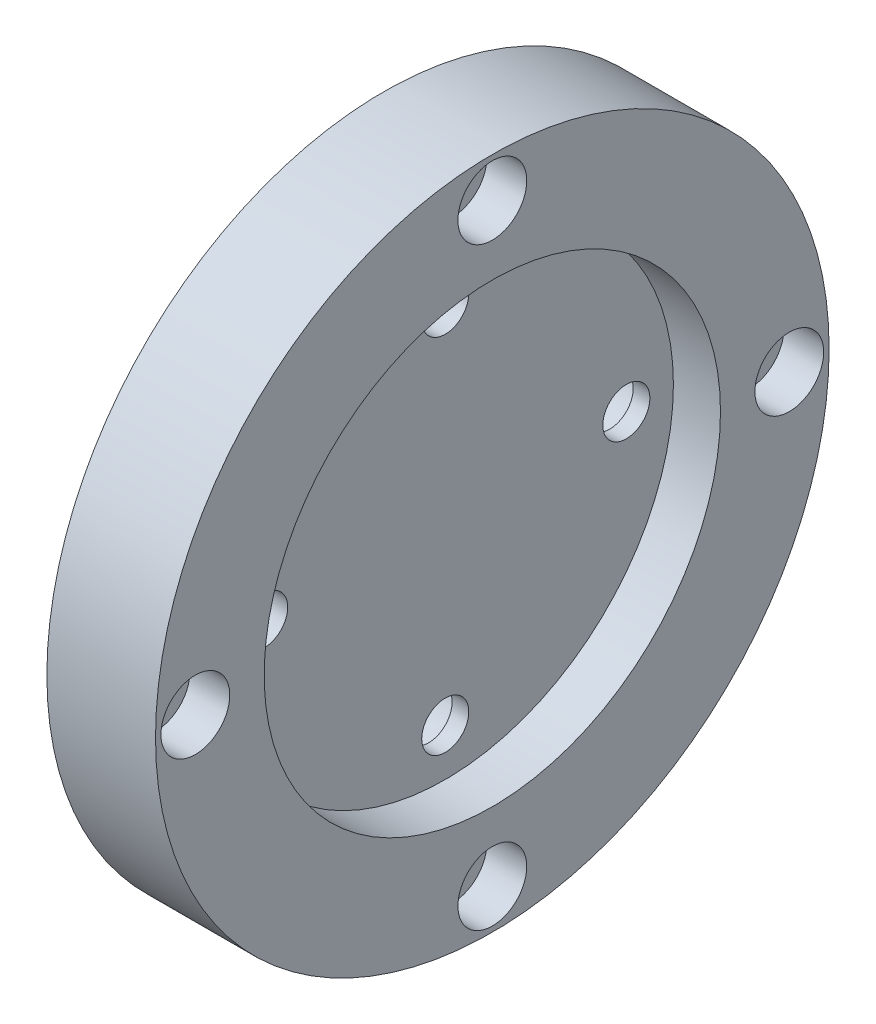
ISO-10303-21;
HEADER;
FILE_DESCRIPTION(('STEP AP214'),'2;1');
FILE_NAME('part.step','',(''),(''),'','','');
FILE_SCHEMA(('AUTOMOTIVE_DESIGN { 1 0 10303 214 1 1 1 1 }'));
ENDSEC;
DATA;
#1=APPLICATION_CONTEXT('core data for automotive mechanical design processes');
#2=APPLICATION_PROTOCOL_DEFINITION('international standard','automotive_design',2000,#1);
#3=PRODUCT_CONTEXT('',#1,'mechanical');
#4=PRODUCT('Part','Part','',(#3));
#5=PRODUCT_RELATED_PRODUCT_CATEGORY('part','',(#4));
#6=PRODUCT_DEFINITION_FORMATION('','',#4);
#7=PRODUCT_DEFINITION_CONTEXT('part definition',#1,'design');
#8=PRODUCT_DEFINITION('design','',#6,#7);
#9=PRODUCT_DEFINITION_SHAPE('','',#8);
#10=(LENGTH_UNIT() NAMED_UNIT(*) SI_UNIT(.MILLI.,.METRE.));
#11=(NAMED_UNIT(*) PLANE_ANGLE_UNIT() SI_UNIT($,.RADIAN.));
#12=(NAMED_UNIT(*) SI_UNIT($,.STERADIAN.) SOLID_ANGLE_UNIT());
#13=UNCERTAINTY_MEASURE_WITH_UNIT(LENGTH_MEASURE(1.E-05),#10,'distance_accuracy_value','');
#14=(GEOMETRIC_REPRESENTATION_CONTEXT(3) GLOBAL_UNCERTAINTY_ASSIGNED_CONTEXT((#13)) GLOBAL_UNIT_ASSIGNED_CONTEXT((#10,
#11,#12)) REPRESENTATION_CONTEXT('',''));
#15=CARTESIAN_POINT('',(0.,0.,0.));
#16=DIRECTION('',(0.,0.,1.));
#17=DIRECTION('',(1.,0.,0.));
#18=AXIS2_PLACEMENT_3D('',#15,#16,#17);
#19=CARTESIAN_POINT('',(0.,0.,-41.));
#20=DIRECTION('',(1.,0.,0.));
#21=DIRECTION('',(0.,0.,-1.));
#22=AXIS2_PLACEMENT_3D('',#19,#20,#21);
#23=CYLINDRICAL_SURFACE('',#22,2.75);
#24=CARTESIAN_POINT('',(0.,0.,-41.));
#25=DIRECTION('',(1.,0.,0.));
#26=DIRECTION('',(0.,0.,-1.));
#27=AXIS2_PLACEMENT_3D('',#24,#25,#26);
#28=CIRCLE('',#27,2.75);
#29=CARTESIAN_POINT('',(0.,0.,-43.75));
#30=VERTEX_POINT('',#29);
#31=EDGE_CURVE('E99',#30,#30,#28,.T.);
#32=ORIENTED_EDGE('',*,*,#31,.F.);
#33=EDGE_LOOP('',(#32));
#34=FACE_BOUND('',#33,.T.);
#35=CARTESIAN_POINT('',(9.5,0.,-41.));
#36=DIRECTION('',(1.,0.,0.));
#37=DIRECTION('',(0.,0.,-1.));
#38=AXIS2_PLACEMENT_3D('',#35,#36,#37);
#39=CIRCLE('',#38,2.75);
#40=CARTESIAN_POINT('',(9.5,0.,-43.75));
#41=VERTEX_POINT('',#40);
#42=EDGE_CURVE('E43',#41,#41,#39,.F.);
#43=ORIENTED_EDGE('',*,*,#42,.F.);
#44=EDGE_LOOP('',(#43));
#45=FACE_BOUND('',#44,.T.);
#46=ADVANCED_FACE('F39',(#34,#45),#23,.F.);
#47=CARTESIAN_POINT('',(0.,0.,41.));
#48=DIRECTION('',(1.,0.,0.));
#49=DIRECTION('',(0.,0.,-1.));
#50=AXIS2_PLACEMENT_3D('',#47,#48,#49);
#51=CYLINDRICAL_SURFACE('',#50,2.75);
#52=CARTESIAN_POINT('',(0.,0.,41.));
#53=DIRECTION('',(1.,0.,0.));
#54=DIRECTION('',(0.,0.,1.));
#55=AXIS2_PLACEMENT_3D('',#52,#53,#54);
#56=CIRCLE('',#55,2.75);
#57=CARTESIAN_POINT('',(0.,0.,43.75));
#58=VERTEX_POINT('',#57);
#59=EDGE_CURVE('E100',#58,#58,#56,.T.);
#60=ORIENTED_EDGE('',*,*,#59,.F.);
#61=EDGE_LOOP('',(#60));
#62=FACE_BOUND('',#61,.T.);
#63=CARTESIAN_POINT('',(9.5,0.,41.));
#64=DIRECTION('',(1.,0.,0.));
#65=DIRECTION('',(0.,0.,-1.));
#66=AXIS2_PLACEMENT_3D('',#63,#64,#65);
#67=CIRCLE('',#66,2.75);
#68=CARTESIAN_POINT('',(9.5,0.,38.25));
#69=VERTEX_POINT('',#68);
#70=EDGE_CURVE('E79',#69,#69,#67,.F.);
#71=ORIENTED_EDGE('',*,*,#70,.F.);
#72=EDGE_LOOP('',(#71));
#73=FACE_BOUND('',#72,.T.);
#74=ADVANCED_FACE('F164',(#62,#73),#51,.F.);
#75=CARTESIAN_POINT('',(0.,41.,1.43150734892568E-13));
#76=DIRECTION('',(1.,0.,0.));
#77=DIRECTION('',(0.,0.,-1.));
#78=AXIS2_PLACEMENT_3D('',#75,#76,#77);
#79=CYLINDRICAL_SURFACE('',#78,2.75);
#80=CARTESIAN_POINT('',(0.,41.,1.43150734892568E-13));
#81=DIRECTION('',(1.,0.,0.));
#82=DIRECTION('',(0.,1.,0.));
#83=AXIS2_PLACEMENT_3D('',#80,#81,#82);
#84=CIRCLE('',#83,2.75);
#85=CARTESIAN_POINT('',(0.,43.75,1.52752308574387E-13));
#86=VERTEX_POINT('',#85);
#87=EDGE_CURVE('E96',#86,#86,#84,.T.);
#88=ORIENTED_EDGE('',*,*,#87,.F.);
#89=EDGE_LOOP('',(#88));
#90=FACE_BOUND('',#89,.T.);
#91=CARTESIAN_POINT('',(9.5,41.,1.43150734892568E-13));
#92=DIRECTION('',(1.,0.,0.));
#93=DIRECTION('',(0.,0.,-1.));
#94=AXIS2_PLACEMENT_3D('',#91,#92,#93);
#95=CIRCLE('',#94,2.75);
#96=CARTESIAN_POINT('',(9.5,41.,-2.74999999999986));
#97=VERTEX_POINT('',#96);
#98=EDGE_CURVE('E77',#97,#97,#95,.F.);
#99=ORIENTED_EDGE('',*,*,#98,.F.);
#100=EDGE_LOOP('',(#99));
#101=FACE_BOUND('',#100,.T.);
#102=ADVANCED_FACE('F170',(#90,#101),#79,.F.);
#103=CARTESIAN_POINT('',(0.,-41.,-4.29452204677705E-13));
#104=DIRECTION('',(1.,0.,0.));
#105=DIRECTION('',(0.,0.,-1.));
#106=AXIS2_PLACEMENT_3D('',#103,#104,#105);
#107=CYLINDRICAL_SURFACE('',#106,2.75);
#108=CARTESIAN_POINT('',(0.,-41.,-4.29452204677705E-13));
#109=DIRECTION('',(1.,0.,0.));
#110=DIRECTION('',(0.,-1.,0.));
#111=AXIS2_PLACEMENT_3D('',#108,#109,#110);
#112=CIRCLE('',#111,2.75);
#113=CARTESIAN_POINT('',(0.,-43.75,-4.58256925723161E-13));
#114=VERTEX_POINT('',#113);
#115=EDGE_CURVE('E75',#114,#114,#112,.T.);
#116=ORIENTED_EDGE('',*,*,#115,.F.);
#117=EDGE_LOOP('',(#116));
#118=FACE_BOUND('',#117,.T.);
#119=CARTESIAN_POINT('',(9.5,-41.,-4.29452204677705E-13));
#120=DIRECTION('',(1.,0.,0.));
#121=DIRECTION('',(0.,0.,-1.));
#122=AXIS2_PLACEMENT_3D('',#119,#120,#121);
#123=CIRCLE('',#122,2.75);
#124=CARTESIAN_POINT('',(9.5,-41.,-2.75000000000043));
#125=VERTEX_POINT('',#124);
#126=EDGE_CURVE('E72',#125,#125,#123,.F.);
#127=ORIENTED_EDGE('',*,*,#126,.F.);
#128=EDGE_LOOP('',(#127));
#129=FACE_BOUND('',#128,.T.);
#130=ADVANCED_FACE('F177',(#118,#129),#107,.F.);
#131=CARTESIAN_POINT('',(0.,25.,0.));
#132=DIRECTION('',(1.,0.,0.));
#133=DIRECTION('',(0.,0.,-1.));
#134=AXIS2_PLACEMENT_3D('',#131,#132,#133);
#135=CYLINDRICAL_SURFACE('',#134,3.25);
#136=CARTESIAN_POINT('',(8.5,25.,0.));
#137=DIRECTION('',(1.,0.,0.));
#138=DIRECTION('',(0.,0.,-1.));
#139=AXIS2_PLACEMENT_3D('',#136,#137,#138);
#140=CIRCLE('',#139,3.25);
#141=CARTESIAN_POINT('',(8.5,25.,-3.25));
#142=VERTEX_POINT('',#141);
#143=EDGE_CURVE('E133',#142,#142,#140,.T.);
#144=ORIENTED_EDGE('',*,*,#143,.T.);
#145=EDGE_LOOP('',(#144));
#146=FACE_BOUND('',#145,.T.);
#147=CARTESIAN_POINT('',(6.2,25.,0.));
#148=DIRECTION('',(-1.,0.,0.));
#149=DIRECTION('',(0.,0.,1.));
#150=AXIS2_PLACEMENT_3D('',#147,#148,#149);
#151=CIRCLE('',#150,3.25);
#152=CARTESIAN_POINT('',(6.2,25.,3.25));
#153=VERTEX_POINT('',#152);
#154=EDGE_CURVE('E68',#153,#153,#151,.F.);
#155=ORIENTED_EDGE('',*,*,#154,.F.);
#156=EDGE_LOOP('',(#155));
#157=FACE_BOUND('',#156,.T.);
#158=ADVANCED_FACE('F222',(#146,#157),#135,.F.);
#159=CARTESIAN_POINT('',(0.,2.61861100413235E-13,25.));
#160=DIRECTION('',(1.,0.,0.));
#161=DIRECTION('',(0.,0.,-1.));
#162=AXIS2_PLACEMENT_3D('',#159,#160,#161);
#163=CYLINDRICAL_SURFACE('',#162,3.25);
#164=CARTESIAN_POINT('',(8.5,2.61861100413235E-13,25.));
#165=DIRECTION('',(1.,0.,0.));
#166=DIRECTION('',(0.,1.,0.));
#167=AXIS2_PLACEMENT_3D('',#164,#165,#166);
#168=CIRCLE('',#167,3.25);
#169=CARTESIAN_POINT('',(8.5,3.25000000000026,25.));
#170=VERTEX_POINT('',#169);
#171=EDGE_CURVE('E71',#170,#170,#168,.T.);
#172=ORIENTED_EDGE('',*,*,#171,.T.);
#173=EDGE_LOOP('',(#172));
#174=FACE_BOUND('',#173,.T.);
#175=CARTESIAN_POINT('',(6.2,2.61861100413235E-13,25.));
#176=DIRECTION('',(-1.,0.,0.));
#177=DIRECTION('',(0.,0.,1.));
#178=AXIS2_PLACEMENT_3D('',#175,#176,#177);
#179=CIRCLE('',#178,3.25);
#180=CARTESIAN_POINT('',(6.2,2.61861100413235E-13,28.25));
#181=VERTEX_POINT('',#180);
#182=EDGE_CURVE('E65',#181,#181,#179,.F.);
#183=ORIENTED_EDGE('',*,*,#182,.F.);
#184=EDGE_LOOP('',(#183));
#185=FACE_BOUND('',#184,.T.);
#186=ADVANCED_FACE('F218',(#174,#185),#163,.F.);
#187=CARTESIAN_POINT('',(0.,-25.,0.));
#188=DIRECTION('',(1.,0.,0.));
#189=DIRECTION('',(0.,0.,-1.));
#190=AXIS2_PLACEMENT_3D('',#187,#188,#189);
#191=CYLINDRICAL_SURFACE('',#190,3.25);
#192=CARTESIAN_POINT('',(8.5,-25.,0.));
#193=DIRECTION('',(1.,0.,0.));
#194=DIRECTION('',(0.,0.,1.));
#195=AXIS2_PLACEMENT_3D('',#192,#193,#194);
#196=CIRCLE('',#195,3.25);
#197=CARTESIAN_POINT('',(8.5,-25.,3.25));
#198=VERTEX_POINT('',#197);
#199=EDGE_CURVE('E134',#198,#198,#196,.T.);
#200=ORIENTED_EDGE('',*,*,#199,.T.);
#201=EDGE_LOOP('',(#200));
#202=FACE_BOUND('',#201,.T.);
#203=CARTESIAN_POINT('',(6.2,-25.,0.));
#204=DIRECTION('',(-1.,0.,0.));
#205=DIRECTION('',(0.,0.,1.));
#206=AXIS2_PLACEMENT_3D('',#203,#204,#205);
#207=CIRCLE('',#206,3.25);
#208=CARTESIAN_POINT('',(6.2,-25.,3.25));
#209=VERTEX_POINT('',#208);
#210=EDGE_CURVE('E61',#209,#209,#207,.F.);
#211=ORIENTED_EDGE('',*,*,#210,.F.);
#212=EDGE_LOOP('',(#211));
#213=FACE_BOUND('',#212,.T.);
#214=ADVANCED_FACE('F214',(#202,#213),#191,.F.);
#215=CARTESIAN_POINT('',(0.,0.,-25.));
#216=DIRECTION('',(1.,0.,0.));
#217=DIRECTION('',(0.,0.,-1.));
#218=AXIS2_PLACEMENT_3D('',#215,#216,#217);
#219=CYLINDRICAL_SURFACE('',#218,3.25);
#220=CARTESIAN_POINT('',(8.5,0.,-25.));
#221=DIRECTION('',(1.,0.,0.));
#222=DIRECTION('',(0.,-1.,0.));
#223=AXIS2_PLACEMENT_3D('',#220,#221,#222);
#224=CIRCLE('',#223,3.25);
#225=CARTESIAN_POINT('',(8.5,-3.25000000000009,-25.));
#226=VERTEX_POINT('',#225);
#227=EDGE_CURVE('E130',#226,#226,#224,.T.);
#228=ORIENTED_EDGE('',*,*,#227,.T.);
#229=EDGE_LOOP('',(#228));
#230=FACE_BOUND('',#229,.T.);
#231=CARTESIAN_POINT('',(6.2,0.,-25.));
#232=DIRECTION('',(-1.,0.,0.));
#233=DIRECTION('',(0.,0.,1.));
#234=AXIS2_PLACEMENT_3D('',#231,#232,#233);
#235=CIRCLE('',#234,3.25);
#236=CARTESIAN_POINT('',(6.2,0.,-21.75));
#237=VERTEX_POINT('',#236);
#238=EDGE_CURVE('E58',#237,#237,#235,.F.);
#239=ORIENTED_EDGE('',*,*,#238,.F.);
#240=EDGE_LOOP('',(#239));
#241=FACE_BOUND('',#240,.T.);
#242=ADVANCED_FACE('F158',(#230,#241),#219,.F.);
#243=CARTESIAN_POINT('',(15.,0.,0.));
#244=DIRECTION('',(-1.,0.,0.));
#245=DIRECTION('',(0.,0.,1.));
#246=AXIS2_PLACEMENT_3D('',#243,#244,#245);
#247=CYLINDRICAL_SURFACE('',#246,46.5);
#248=CARTESIAN_POINT('',(15.,0.,0.));
#249=DIRECTION('',(1.,0.,0.));
#250=DIRECTION('',(0.,0.,-1.));
#251=AXIS2_PLACEMENT_3D('',#248,#249,#250);
#252=CIRCLE('',#251,46.5);
#253=CARTESIAN_POINT('',(15.,0.,-46.5));
#254=VERTEX_POINT('',#253);
#255=EDGE_CURVE('E10',#254,#254,#252,.T.);
#256=ORIENTED_EDGE('',*,*,#255,.F.);
#257=EDGE_LOOP('',(#256));
#258=FACE_BOUND('',#257,.T.);
#259=CARTESIAN_POINT('',(0.,0.,0.));
#260=DIRECTION('',(1.,0.,0.));
#261=DIRECTION('',(0.,0.,-1.));
#262=AXIS2_PLACEMENT_3D('',#259,#260,#261);
#263=CIRCLE('',#262,46.5);
#264=CARTESIAN_POINT('',(0.,0.,-46.5));
#265=VERTEX_POINT('',#264);
#266=EDGE_CURVE('E47',#265,#265,#263,.T.);
#267=ORIENTED_EDGE('',*,*,#266,.T.);
#268=EDGE_LOOP('',(#267));
#269=FACE_BOUND('',#268,.T.);
#270=ADVANCED_FACE('F41',(#258,#269),#247,.T.);
#271=CARTESIAN_POINT('',(15.,0.,0.));
#272=DIRECTION('',(1.,0.,0.));
#273=DIRECTION('',(0.,0.,-1.));
#274=AXIS2_PLACEMENT_3D('',#271,#272,#273);
#275=PLANE('',#274);
#276=CARTESIAN_POINT('',(15.,5.73362156934817E-13,-41.));
#277=DIRECTION('',(1.,0.,0.));
#278=DIRECTION('',(0.,1.,0.));
#279=AXIS2_PLACEMENT_3D('',#276,#277,#278);
#280=CIRCLE('',#279,4.75);
#281=CARTESIAN_POINT('',(15.,4.75000000000057,-41.));
#282=VERTEX_POINT('',#281);
#283=EDGE_CURVE('E527',#282,#282,#280,.T.);
#284=ORIENTED_EDGE('',*,*,#283,.F.);
#285=EDGE_LOOP('',(#284));
#286=FACE_BOUND('',#285,.T.);
#287=CARTESIAN_POINT('',(15.,41.,4.30211422042248E-13));
#288=DIRECTION('',(1.,0.,0.));
#289=DIRECTION('',(0.,0.,1.));
#290=AXIS2_PLACEMENT_3D('',#287,#288,#289);
#291=CIRCLE('',#290,4.75);
#292=CARTESIAN_POINT('',(15.,41.,4.75000000000043));
#293=VERTEX_POINT('',#292);
#294=EDGE_CURVE('E532',#293,#293,#291,.T.);
#295=ORIENTED_EDGE('',*,*,#294,.F.);
#296=EDGE_LOOP('',(#295));
#297=FACE_BOUND('',#296,.T.);
#298=CARTESIAN_POINT('',(15.,-8.59663626719954E-13,41.));
#299=DIRECTION('',(1.,0.,0.));
#300=DIRECTION('',(0.,-1.,0.));
#301=AXIS2_PLACEMENT_3D('',#298,#299,#300);
#302=CIRCLE('',#301,4.75);
#303=CARTESIAN_POINT('',(15.,-4.75000000000086,41.));
#304=VERTEX_POINT('',#303);
#305=EDGE_CURVE('E539',#304,#304,#302,.T.);
#306=ORIENTED_EDGE('',*,*,#305,.F.);
#307=EDGE_LOOP('',(#306));
#308=FACE_BOUND('',#307,.T.);
#309=CARTESIAN_POINT('',(15.,-41.,-4.30211422042248E-13));
#310=DIRECTION('',(1.,0.,0.));
#311=DIRECTION('',(0.,0.,-1.));
#312=AXIS2_PLACEMENT_3D('',#309,#310,#311);
#313=CIRCLE('',#312,4.75);
#314=CARTESIAN_POINT('',(15.,-41.,-4.75000000000043));
#315=VERTEX_POINT('',#314);
#316=EDGE_CURVE('E85',#315,#315,#313,.T.);
#317=ORIENTED_EDGE('',*,*,#316,.F.);
#318=EDGE_LOOP('',(#317));
#319=FACE_BOUND('',#318,.T.);
#320=CARTESIAN_POINT('',(15.,0.,0.));
#321=DIRECTION('',(1.,0.,0.));
#322=DIRECTION('',(0.,0.,-1.));
#323=AXIS2_PLACEMENT_3D('',#320,#321,#322);
#324=CIRCLE('',#323,31.5);
#325=CARTESIAN_POINT('',(15.,0.,-31.5));
#326=VERTEX_POINT('',#325);
#327=EDGE_CURVE('E55',#326,#326,#324,.T.);
#328=ORIENTED_EDGE('',*,*,#327,.F.);
#329=EDGE_LOOP('',(#328));
#330=FACE_BOUND('',#329,.T.);
#331=ORIENTED_EDGE('',*,*,#255,.T.);
#332=EDGE_LOOP('',(#331));
#333=FACE_BOUND('',#332,.T.);
#334=ADVANCED_FACE('F148',(#286,#297,#308,#319,#330,#333),#275,.T.);
#335=CARTESIAN_POINT('',(0.,0.,0.));
#336=DIRECTION('',(1.,0.,0.));
#337=DIRECTION('',(0.,0.,-1.));
#338=AXIS2_PLACEMENT_3D('',#335,#336,#337);
#339=PLANE('',#338);
#340=ORIENTED_EDGE('',*,*,#87,.T.);
#341=EDGE_LOOP('',(#340));
#342=FACE_BOUND('',#341,.T.);
#343=ORIENTED_EDGE('',*,*,#59,.T.);
#344=EDGE_LOOP('',(#343));
#345=FACE_BOUND('',#344,.T.);
#346=ORIENTED_EDGE('',*,*,#115,.T.);
#347=EDGE_LOOP('',(#346));
#348=FACE_BOUND('',#347,.T.);
#349=ORIENTED_EDGE('',*,*,#31,.T.);
#350=EDGE_LOOP('',(#349));
#351=FACE_BOUND('',#350,.T.);
#352=CARTESIAN_POINT('',(0.,25.,0.));
#353=DIRECTION('',(-1.,0.,0.));
#354=DIRECTION('',(0.,0.,1.));
#355=AXIS2_PLACEMENT_3D('',#352,#353,#354);
#356=CIRCLE('',#355,5.5);
#357=CARTESIAN_POINT('',(0.,25.,5.5));
#358=VERTEX_POINT('',#357);
#359=EDGE_CURVE('E110',#358,#358,#356,.T.);
#360=ORIENTED_EDGE('',*,*,#359,.F.);
#361=EDGE_LOOP('',(#360));
#362=FACE_BOUND('',#361,.T.);
#363=CARTESIAN_POINT('',(0.,0.,-25.));
#364=DIRECTION('',(-1.,0.,0.));
#365=DIRECTION('',(0.,0.,1.));
#366=AXIS2_PLACEMENT_3D('',#363,#364,#365);
#367=CIRCLE('',#366,5.5);
#368=CARTESIAN_POINT('',(0.,0.,-19.5));
#369=VERTEX_POINT('',#368);
#370=EDGE_CURVE('E113',#369,#369,#367,.T.);
#371=ORIENTED_EDGE('',*,*,#370,.F.);
#372=EDGE_LOOP('',(#371));
#373=FACE_BOUND('',#372,.T.);
#374=CARTESIAN_POINT('',(0.,-25.,0.));
#375=DIRECTION('',(-1.,0.,0.));
#376=DIRECTION('',(0.,0.,1.));
#377=AXIS2_PLACEMENT_3D('',#374,#375,#376);
#378=CIRCLE('',#377,5.5);
#379=CARTESIAN_POINT('',(0.,-25.,5.5));
#380=VERTEX_POINT('',#379);
#381=EDGE_CURVE('E119',#380,#380,#378,.T.);
#382=ORIENTED_EDGE('',*,*,#381,.F.);
#383=EDGE_LOOP('',(#382));
#384=FACE_BOUND('',#383,.T.);
#385=CARTESIAN_POINT('',(0.,2.61861100413235E-13,25.));
#386=DIRECTION('',(-1.,0.,0.));
#387=DIRECTION('',(0.,0.,1.));
#388=AXIS2_PLACEMENT_3D('',#385,#386,#387);
#389=CIRCLE('',#388,5.5);
#390=CARTESIAN_POINT('',(0.,2.61861100413235E-13,30.5));
#391=VERTEX_POINT('',#390);
#392=EDGE_CURVE('E125',#391,#391,#389,.T.);
#393=ORIENTED_EDGE('',*,*,#392,.F.);
#394=EDGE_LOOP('',(#393));
#395=FACE_BOUND('',#394,.T.);
#396=ORIENTED_EDGE('',*,*,#266,.F.);
#397=EDGE_LOOP('',(#396));
#398=FACE_BOUND('',#397,.T.);
#399=ADVANCED_FACE('F150',(#342,#345,#348,#351,#362,#373,#384,#395,#398),#339,.F.);
#400=CARTESIAN_POINT('',(8.5,0.,0.));
#401=DIRECTION('',(1.,0.,0.));
#402=DIRECTION('',(0.,0.,-1.));
#403=AXIS2_PLACEMENT_3D('',#400,#401,#402);
#404=CYLINDRICAL_SURFACE('',#403,31.5);
#405=CARTESIAN_POINT('',(8.5,0.,0.));
#406=DIRECTION('',(1.,0.,0.));
#407=DIRECTION('',(0.,0.,-1.));
#408=AXIS2_PLACEMENT_3D('',#405,#406,#407);
#409=CIRCLE('',#408,31.5);
#410=CARTESIAN_POINT('',(8.5,0.,-31.5));
#411=VERTEX_POINT('',#410);
#412=EDGE_CURVE('E52',#411,#411,#409,.T.);
#413=ORIENTED_EDGE('',*,*,#412,.F.);
#414=EDGE_LOOP('',(#413));
#415=FACE_BOUND('',#414,.T.);
#416=ORIENTED_EDGE('',*,*,#327,.T.);
#417=EDGE_LOOP('',(#416));
#418=FACE_BOUND('',#417,.T.);
#419=ADVANCED_FACE('F146',(#415,#418),#404,.F.);
#420=CARTESIAN_POINT('',(8.5,0.,0.));
#421=DIRECTION('',(1.,0.,0.));
#422=DIRECTION('',(0.,0.,-1.));
#423=AXIS2_PLACEMENT_3D('',#420,#421,#422);
#424=PLANE('',#423);
#425=ORIENTED_EDGE('',*,*,#227,.F.);
#426=EDGE_LOOP('',(#425));
#427=FACE_BOUND('',#426,.T.);
#428=ORIENTED_EDGE('',*,*,#199,.F.);
#429=EDGE_LOOP('',(#428));
#430=FACE_BOUND('',#429,.T.);
#431=ORIENTED_EDGE('',*,*,#171,.F.);
#432=EDGE_LOOP('',(#431));
#433=FACE_BOUND('',#432,.T.);
#434=ORIENTED_EDGE('',*,*,#143,.F.);
#435=EDGE_LOOP('',(#434));
#436=FACE_BOUND('',#435,.T.);
#437=ORIENTED_EDGE('',*,*,#412,.T.);
#438=EDGE_LOOP('',(#437));
#439=FACE_BOUND('',#438,.T.);
#440=ADVANCED_FACE('F196',(#427,#430,#433,#436,#439),#424,.T.);
#441=CARTESIAN_POINT('',(6.2,0.,-25.));
#442=DIRECTION('',(-1.,0.,0.));
#443=DIRECTION('',(0.,0.,1.));
#444=AXIS2_PLACEMENT_3D('',#441,#442,#443);
#445=PLANE('',#444);
#446=CARTESIAN_POINT('',(6.2,0.,-25.));
#447=DIRECTION('',(-1.,0.,0.));
#448=DIRECTION('',(0.,0.,1.));
#449=AXIS2_PLACEMENT_3D('',#446,#447,#448);
#450=CIRCLE('',#449,5.5);
#451=CARTESIAN_POINT('',(6.2,0.,-19.5));
#452=VERTEX_POINT('',#451);
#453=EDGE_CURVE('E116',#452,#452,#450,.T.);
#454=ORIENTED_EDGE('',*,*,#453,.T.);
#455=EDGE_LOOP('',(#454));
#456=FACE_BOUND('',#455,.T.);
#457=ORIENTED_EDGE('',*,*,#238,.T.);
#458=EDGE_LOOP('',(#457));
#459=FACE_BOUND('',#458,.T.);
#460=ADVANCED_FACE('F192',(#456,#459),#445,.T.);
#461=CARTESIAN_POINT('',(6.2,0.,-25.));
#462=DIRECTION('',(-1.,0.,0.));
#463=DIRECTION('',(0.,0.,1.));
#464=AXIS2_PLACEMENT_3D('',#461,#462,#463);
#465=CYLINDRICAL_SURFACE('',#464,5.5);
#466=ORIENTED_EDGE('',*,*,#453,.F.);
#467=EDGE_LOOP('',(#466));
#468=FACE_BOUND('',#467,.T.);
#469=ORIENTED_EDGE('',*,*,#370,.T.);
#470=EDGE_LOOP('',(#469));
#471=FACE_BOUND('',#470,.T.);
#472=ADVANCED_FACE('F188',(#468,#471),#465,.F.);
#473=CARTESIAN_POINT('',(6.2,-25.,0.));
#474=DIRECTION('',(-1.,0.,0.));
#475=DIRECTION('',(0.,0.,1.));
#476=AXIS2_PLACEMENT_3D('',#473,#474,#475);
#477=PLANE('',#476);
#478=CARTESIAN_POINT('',(6.2,-25.,0.));
#479=DIRECTION('',(-1.,0.,0.));
#480=DIRECTION('',(0.,0.,1.));
#481=AXIS2_PLACEMENT_3D('',#478,#479,#480);
#482=CIRCLE('',#481,5.5);
#483=CARTESIAN_POINT('',(6.2,-25.,5.5));
#484=VERTEX_POINT('',#483);
#485=EDGE_CURVE('E122',#484,#484,#482,.T.);
#486=ORIENTED_EDGE('',*,*,#485,.T.);
#487=EDGE_LOOP('',(#486));
#488=FACE_BOUND('',#487,.T.);
#489=ORIENTED_EDGE('',*,*,#210,.T.);
#490=EDGE_LOOP('',(#489));
#491=FACE_BOUND('',#490,.T.);
#492=ADVANCED_FACE('F191',(#488,#491),#477,.T.);
#493=CARTESIAN_POINT('',(6.2,-25.,0.));
#494=DIRECTION('',(-1.,0.,0.));
#495=DIRECTION('',(0.,0.,1.));
#496=AXIS2_PLACEMENT_3D('',#493,#494,#495);
#497=CYLINDRICAL_SURFACE('',#496,5.5);
#498=ORIENTED_EDGE('',*,*,#485,.F.);
#499=EDGE_LOOP('',(#498));
#500=FACE_BOUND('',#499,.T.);
#501=ORIENTED_EDGE('',*,*,#381,.T.);
#502=EDGE_LOOP('',(#501));
#503=FACE_BOUND('',#502,.T.);
#504=ADVANCED_FACE('F198',(#500,#503),#497,.F.);
#505=CARTESIAN_POINT('',(6.2,2.61861100413235E-13,25.));
#506=DIRECTION('',(-1.,0.,0.));
#507=DIRECTION('',(0.,0.,1.));
#508=AXIS2_PLACEMENT_3D('',#505,#506,#507);
#509=PLANE('',#508);
#510=CARTESIAN_POINT('',(6.2,2.61861100413235E-13,25.));
#511=DIRECTION('',(-1.,0.,0.));
#512=DIRECTION('',(0.,0.,1.));
#513=AXIS2_PLACEMENT_3D('',#510,#511,#512);
#514=CIRCLE('',#513,5.5);
#515=CARTESIAN_POINT('',(6.2,2.61861100413235E-13,30.5));
#516=VERTEX_POINT('',#515);
#517=EDGE_CURVE('E107',#516,#516,#514,.T.);
#518=ORIENTED_EDGE('',*,*,#517,.T.);
#519=EDGE_LOOP('',(#518));
#520=FACE_BOUND('',#519,.T.);
#521=ORIENTED_EDGE('',*,*,#182,.T.);
#522=EDGE_LOOP('',(#521));
#523=FACE_BOUND('',#522,.T.);
#524=ADVANCED_FACE('F201',(#520,#523),#509,.T.);
#525=CARTESIAN_POINT('',(6.2,2.61861100413235E-13,25.));
#526=DIRECTION('',(-1.,0.,0.));
#527=DIRECTION('',(0.,0.,1.));
#528=AXIS2_PLACEMENT_3D('',#525,#526,#527);
#529=CYLINDRICAL_SURFACE('',#528,5.5);
#530=ORIENTED_EDGE('',*,*,#517,.F.);
#531=EDGE_LOOP('',(#530));
#532=FACE_BOUND('',#531,.T.);
#533=ORIENTED_EDGE('',*,*,#392,.T.);
#534=EDGE_LOOP('',(#533));
#535=FACE_BOUND('',#534,.T.);
#536=ADVANCED_FACE('F182',(#532,#535),#529,.F.);
#537=CARTESIAN_POINT('',(6.2,25.,0.));
#538=DIRECTION('',(-1.,0.,0.));
#539=DIRECTION('',(0.,0.,1.));
#540=AXIS2_PLACEMENT_3D('',#537,#538,#539);
#541=PLANE('',#540);
#542=CARTESIAN_POINT('',(6.2,25.,0.));
#543=DIRECTION('',(-1.,0.,0.));
#544=DIRECTION('',(0.,0.,1.));
#545=AXIS2_PLACEMENT_3D('',#542,#543,#544);
#546=CIRCLE('',#545,5.5);
#547=CARTESIAN_POINT('',(6.2,25.,5.5));
#548=VERTEX_POINT('',#547);
#549=EDGE_CURVE('E62',#548,#548,#546,.T.);
#550=ORIENTED_EDGE('',*,*,#549,.T.);
#551=EDGE_LOOP('',(#550));
#552=FACE_BOUND('',#551,.T.);
#553=ORIENTED_EDGE('',*,*,#154,.T.);
#554=EDGE_LOOP('',(#553));
#555=FACE_BOUND('',#554,.T.);
#556=ADVANCED_FACE('F178',(#552,#555),#541,.T.);
#557=CARTESIAN_POINT('',(6.2,25.,0.));
#558=DIRECTION('',(-1.,0.,0.));
#559=DIRECTION('',(0.,0.,1.));
#560=AXIS2_PLACEMENT_3D('',#557,#558,#559);
#561=CYLINDRICAL_SURFACE('',#560,5.5);
#562=ORIENTED_EDGE('',*,*,#549,.F.);
#563=EDGE_LOOP('',(#562));
#564=FACE_BOUND('',#563,.T.);
#565=ORIENTED_EDGE('',*,*,#359,.T.);
#566=EDGE_LOOP('',(#565));
#567=FACE_BOUND('',#566,.T.);
#568=ADVANCED_FACE('F181',(#564,#567),#561,.F.);
#569=CARTESIAN_POINT('',(9.5,-41.,-4.30211422042248E-13));
#570=DIRECTION('',(1.,0.,0.));
#571=DIRECTION('',(0.,0.,-1.));
#572=AXIS2_PLACEMENT_3D('',#569,#570,#571);
#573=PLANE('',#572);
#574=CARTESIAN_POINT('',(9.5,-41.,-4.30211422042248E-13));
#575=DIRECTION('',(1.,0.,0.));
#576=DIRECTION('',(0.,0.,-1.));
#577=AXIS2_PLACEMENT_3D('',#574,#575,#576);
#578=CIRCLE('',#577,4.75);
#579=CARTESIAN_POINT('',(9.5,-41.,-4.75000000000043));
#580=VERTEX_POINT('',#579);
#581=EDGE_CURVE('E76',#580,#580,#578,.T.);
#582=ORIENTED_EDGE('',*,*,#581,.T.);
#583=EDGE_LOOP('',(#582));
#584=FACE_BOUND('',#583,.T.);
#585=ORIENTED_EDGE('',*,*,#126,.T.);
#586=EDGE_LOOP('',(#585));
#587=FACE_BOUND('',#586,.T.);
#588=ADVANCED_FACE('F186',(#584,#587),#573,.T.);
#589=CARTESIAN_POINT('',(9.5,-41.,-4.30211422042248E-13));
#590=DIRECTION('',(1.,0.,0.));
#591=DIRECTION('',(0.,0.,-1.));
#592=AXIS2_PLACEMENT_3D('',#589,#590,#591);
#593=CYLINDRICAL_SURFACE('',#592,4.75);
#594=ORIENTED_EDGE('',*,*,#581,.F.);
#595=EDGE_LOOP('',(#594));
#596=FACE_BOUND('',#595,.T.);
#597=ORIENTED_EDGE('',*,*,#316,.T.);
#598=EDGE_LOOP('',(#597));
#599=FACE_BOUND('',#598,.T.);
#600=ADVANCED_FACE('F280',(#596,#599),#593,.F.);
#601=CARTESIAN_POINT('',(9.5,41.,4.30211422042248E-13));
#602=DIRECTION('',(1.,0.,0.));
#603=DIRECTION('',(0.,0.,1.));
#604=AXIS2_PLACEMENT_3D('',#601,#602,#603);
#605=PLANE('',#604);
#606=CARTESIAN_POINT('',(9.5,41.,4.30211422042248E-13));
#607=DIRECTION('',(1.,0.,0.));
#608=DIRECTION('',(0.,0.,1.));
#609=AXIS2_PLACEMENT_3D('',#606,#607,#608);
#610=CIRCLE('',#609,4.75);
#611=CARTESIAN_POINT('',(9.5,41.,4.75000000000043));
#612=VERTEX_POINT('',#611);
#613=EDGE_CURVE('E528',#612,#612,#610,.T.);
#614=ORIENTED_EDGE('',*,*,#613,.T.);
#615=EDGE_LOOP('',(#614));
#616=FACE_BOUND('',#615,.T.);
#617=ORIENTED_EDGE('',*,*,#98,.T.);
#618=EDGE_LOOP('',(#617));
#619=FACE_BOUND('',#618,.T.);
#620=ADVANCED_FACE('F289',(#616,#619),#605,.T.);
#621=CARTESIAN_POINT('',(9.5,41.,4.30211422042248E-13));
#622=DIRECTION('',(1.,0.,0.));
#623=DIRECTION('',(0.,0.,-1.));
#624=AXIS2_PLACEMENT_3D('',#621,#622,#623);
#625=CYLINDRICAL_SURFACE('',#624,4.75);
#626=ORIENTED_EDGE('',*,*,#613,.F.);
#627=EDGE_LOOP('',(#626));
#628=FACE_BOUND('',#627,.T.);
#629=ORIENTED_EDGE('',*,*,#294,.T.);
#630=EDGE_LOOP('',(#629));
#631=FACE_BOUND('',#630,.T.);
#632=ADVANCED_FACE('F297',(#628,#631),#625,.F.);
#633=CARTESIAN_POINT('',(9.5,-8.59663626719954E-13,41.));
#634=DIRECTION('',(1.,0.,0.));
#635=DIRECTION('',(0.,-1.,0.));
#636=AXIS2_PLACEMENT_3D('',#633,#634,#635);
#637=PLANE('',#636);
#638=CARTESIAN_POINT('',(9.5,-8.59663626719954E-13,41.));
#639=DIRECTION('',(1.,0.,0.));
#640=DIRECTION('',(0.,-1.,0.));
#641=AXIS2_PLACEMENT_3D('',#638,#639,#640);
#642=CIRCLE('',#641,4.75);
#643=CARTESIAN_POINT('',(9.5,-4.75000000000086,41.));
#644=VERTEX_POINT('',#643);
#645=EDGE_CURVE('E537',#644,#644,#642,.T.);
#646=ORIENTED_EDGE('',*,*,#645,.T.);
#647=EDGE_LOOP('',(#646));
#648=FACE_BOUND('',#647,.T.);
#649=ORIENTED_EDGE('',*,*,#70,.T.);
#650=EDGE_LOOP('',(#649));
#651=FACE_BOUND('',#650,.T.);
#652=ADVANCED_FACE('F305',(#648,#651),#637,.T.);
#653=CARTESIAN_POINT('',(9.5,-8.59663626719954E-13,41.));
#654=DIRECTION('',(1.,0.,0.));
#655=DIRECTION('',(0.,0.,-1.));
#656=AXIS2_PLACEMENT_3D('',#653,#654,#655);
#657=CYLINDRICAL_SURFACE('',#656,4.75);
#658=ORIENTED_EDGE('',*,*,#645,.F.);
#659=EDGE_LOOP('',(#658));
#660=FACE_BOUND('',#659,.T.);
#661=ORIENTED_EDGE('',*,*,#305,.T.);
#662=EDGE_LOOP('',(#661));
#663=FACE_BOUND('',#662,.T.);
#664=ADVANCED_FACE('F313',(#660,#663),#657,.F.);
#665=CARTESIAN_POINT('',(9.5,5.73362156934817E-13,-41.));
#666=DIRECTION('',(1.,0.,0.));
#667=DIRECTION('',(0.,1.,0.));
#668=AXIS2_PLACEMENT_3D('',#665,#666,#667);
#669=PLANE('',#668);
#670=CARTESIAN_POINT('',(9.5,5.73362156934817E-13,-41.));
#671=DIRECTION('',(1.,0.,0.));
#672=DIRECTION('',(0.,1.,0.));
#673=AXIS2_PLACEMENT_3D('',#670,#671,#672);
#674=CIRCLE('',#673,4.75);
#675=CARTESIAN_POINT('',(9.5,4.75000000000057,-41.));
#676=VERTEX_POINT('',#675);
#677=EDGE_CURVE('E80',#676,#676,#674,.T.);
#678=ORIENTED_EDGE('',*,*,#677,.T.);
#679=EDGE_LOOP('',(#678));
#680=FACE_BOUND('',#679,.T.);
#681=ORIENTED_EDGE('',*,*,#42,.T.);
#682=EDGE_LOOP('',(#681));
#683=FACE_BOUND('',#682,.T.);
#684=ADVANCED_FACE('F321',(#680,#683),#669,.T.);
#685=CARTESIAN_POINT('',(9.5,5.73362156934817E-13,-41.));
#686=DIRECTION('',(1.,0.,0.));
#687=DIRECTION('',(0.,0.,-1.));
#688=AXIS2_PLACEMENT_3D('',#685,#686,#687);
#689=CYLINDRICAL_SURFACE('',#688,4.75);
#690=ORIENTED_EDGE('',*,*,#677,.F.);
#691=EDGE_LOOP('',(#690));
#692=FACE_BOUND('',#691,.T.);
#693=ORIENTED_EDGE('',*,*,#283,.T.);
#694=EDGE_LOOP('',(#693));
#695=FACE_BOUND('',#694,.T.);
#696=ADVANCED_FACE('F329',(#692,#695),#689,.F.);
#697=CLOSED_SHELL('',(#46,#74,#102,#130,#158,#186,#214,#242,#270,#334,#399,#419,#440,#460,#472,
#492,#504,#524,#536,#556,#568,#588,#600,#620,#632,#652,#664,#684,#696));
#698=MANIFOLD_SOLID_BREP('B2',#697);
#699=ADVANCED_BREP_SHAPE_REPRESENTATION('',(#18,#698),#14);
#700=SHAPE_DEFINITION_REPRESENTATION(#9,#699);
ENDSEC;
END-ISO-10303-21;
